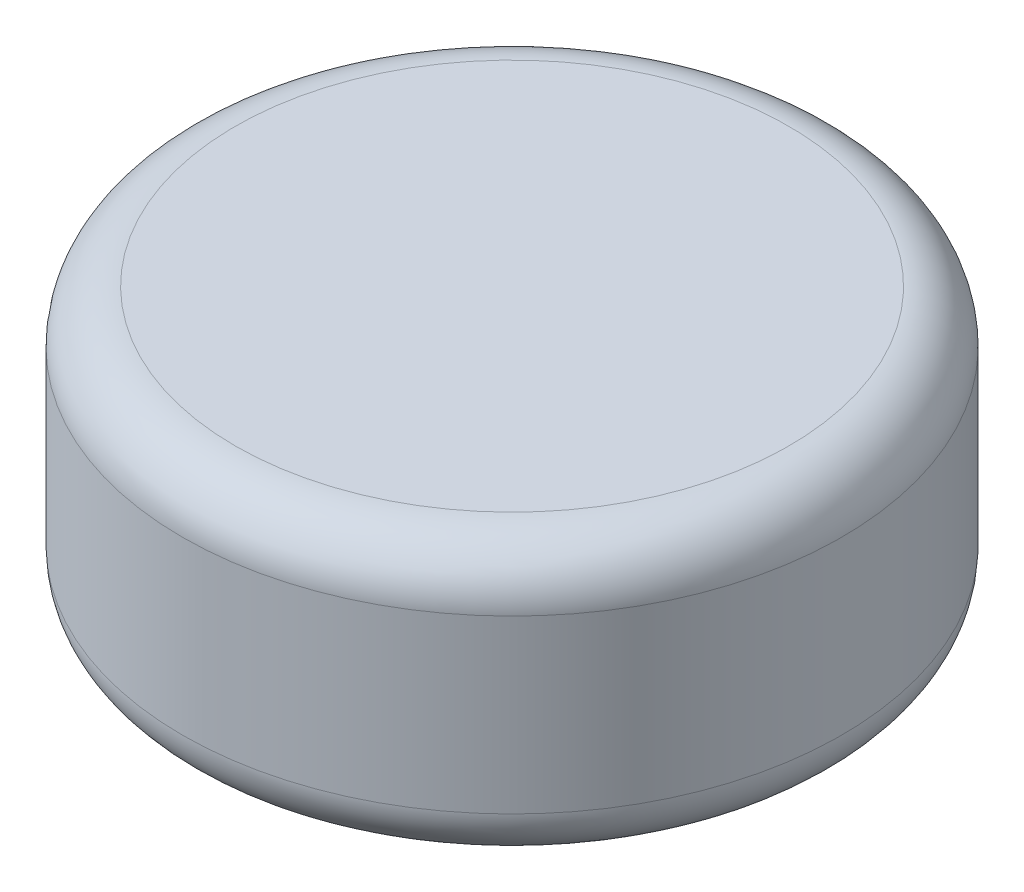
ISO-10303-21;
HEADER;
FILE_DESCRIPTION(('STEP AP214'),'2;1');
FILE_NAME('part.step','',(''),(''),'','','');
FILE_SCHEMA(('AUTOMOTIVE_DESIGN { 1 0 10303 214 1 1 1 1 }'));
ENDSEC;
DATA;
#1=APPLICATION_CONTEXT('core data for automotive mechanical design processes');
#2=APPLICATION_PROTOCOL_DEFINITION('international standard','automotive_design',2000,#1);
#3=PRODUCT_CONTEXT('',#1,'mechanical');
#4=PRODUCT('Part','Part','',(#3));
#5=PRODUCT_RELATED_PRODUCT_CATEGORY('part','',(#4));
#6=PRODUCT_DEFINITION_FORMATION('','',#4);
#7=PRODUCT_DEFINITION_CONTEXT('part definition',#1,'design');
#8=PRODUCT_DEFINITION('design','',#6,#7);
#9=PRODUCT_DEFINITION_SHAPE('','',#8);
#10=(LENGTH_UNIT() NAMED_UNIT(*) SI_UNIT(.MILLI.,.METRE.));
#11=(NAMED_UNIT(*) PLANE_ANGLE_UNIT() SI_UNIT($,.RADIAN.));
#12=(NAMED_UNIT(*) SI_UNIT($,.STERADIAN.) SOLID_ANGLE_UNIT());
#13=UNCERTAINTY_MEASURE_WITH_UNIT(LENGTH_MEASURE(1.E-05),#10,'distance_accuracy_value','');
#14=(GEOMETRIC_REPRESENTATION_CONTEXT(3) GLOBAL_UNCERTAINTY_ASSIGNED_CONTEXT((#13)) GLOBAL_UNIT_ASSIGNED_CONTEXT((#10,
#11,#12)) REPRESENTATION_CONTEXT('',''));
#15=CARTESIAN_POINT('',(0.,0.,0.));
#16=DIRECTION('',(0.,0.,1.));
#17=DIRECTION('',(1.,0.,0.));
#18=AXIS2_PLACEMENT_3D('',#15,#16,#17);
#19=CARTESIAN_POINT('',(0.,4.0005,0.));
#20=DIRECTION('',(0.,-1.,0.));
#21=DIRECTION('',(0.,0.,-1.));
#22=AXIS2_PLACEMENT_3D('',#19,#20,#21);
#23=CYLINDRICAL_SURFACE('',#22,9.525);
#24=CARTESIAN_POINT('',(0.,2.4765,0.));
#25=DIRECTION('',(0.,1.,0.));
#26=DIRECTION('',(0.,0.,1.));
#27=AXIS2_PLACEMENT_3D('',#24,#25,#26);
#28=CIRCLE('',#27,9.525);
#29=CARTESIAN_POINT('',(0.,2.4765,9.525));
#30=VERTEX_POINT('',#29);
#31=EDGE_CURVE('E52',#30,#30,#28,.F.);
#32=ORIENTED_EDGE('',*,*,#31,.T.);
#33=EDGE_LOOP('',(#32));
#34=FACE_BOUND('',#33,.T.);
#35=CARTESIAN_POINT('',(0.,-2.4765,0.));
#36=DIRECTION('',(0.,1.,0.));
#37=DIRECTION('',(0.,0.,1.));
#38=AXIS2_PLACEMENT_3D('',#35,#36,#37);
#39=CIRCLE('',#38,9.525);
#40=CARTESIAN_POINT('',(0.,-2.4765,9.525));
#41=VERTEX_POINT('',#40);
#42=EDGE_CURVE('E139',#41,#41,#39,.T.);
#43=ORIENTED_EDGE('',*,*,#42,.T.);
#44=EDGE_LOOP('',(#43));
#45=FACE_BOUND('',#44,.T.);
#46=ADVANCED_FACE('F42',(#34,#45),#23,.T.);
#47=CARTESIAN_POINT('',(0.,4.0005,0.));
#48=DIRECTION('',(0.,1.,0.));
#49=DIRECTION('',(0.,0.,1.));
#50=AXIS2_PLACEMENT_3D('',#47,#48,#49);
#51=PLANE('',#50);
#52=CARTESIAN_POINT('',(0.,4.0005,0.));
#53=DIRECTION('',(0.,1.,0.));
#54=DIRECTION('',(0.,0.,1.));
#55=AXIS2_PLACEMENT_3D('',#52,#53,#54);
#56=CIRCLE('',#55,8.001);
#57=CARTESIAN_POINT('',(0.,4.0005,8.001));
#58=VERTEX_POINT('',#57);
#59=EDGE_CURVE('E131',#58,#58,#56,.T.);
#60=ORIENTED_EDGE('',*,*,#59,.T.);
#61=EDGE_LOOP('',(#60));
#62=FACE_BOUND('',#61,.T.);
#63=ADVANCED_FACE('F154',(#62),#51,.T.);
#64=CARTESIAN_POINT('',(0.,-4.0005,0.));
#65=DIRECTION('',(0.,1.,0.));
#66=DIRECTION('',(0.,0.,1.));
#67=AXIS2_PLACEMENT_3D('',#64,#65,#66);
#68=PLANE('',#67);
#69=CARTESIAN_POINT('',(0.,-4.0005,0.));
#70=DIRECTION('',(0.,1.,0.));
#71=DIRECTION('',(0.,0.,1.));
#72=AXIS2_PLACEMENT_3D('',#69,#70,#71);
#73=CIRCLE('',#72,8.001);
#74=CARTESIAN_POINT('',(0.,-4.0005,8.001));
#75=VERTEX_POINT('',#74);
#76=EDGE_CURVE('E11',#75,#75,#73,.F.);
#77=ORIENTED_EDGE('',*,*,#76,.T.);
#78=EDGE_LOOP('',(#77));
#79=FACE_BOUND('',#78,.T.);
#80=ADVANCED_FACE('F151',(#79),#68,.F.);
#81=CARTESIAN_POINT('',(0.,2.4765,0.));
#82=DIRECTION('',(0.,1.,0.));
#83=DIRECTION('',(0.,0.,1.));
#84=AXIS2_PLACEMENT_3D('',#81,#82,#83);
#85=TOROIDAL_SURFACE('',#84,8.001,1.524);
#86=ORIENTED_EDGE('',*,*,#31,.F.);
#87=EDGE_LOOP('',(#86));
#88=FACE_BOUND('',#87,.T.);
#89=ORIENTED_EDGE('',*,*,#59,.F.);
#90=EDGE_LOOP('',(#89));
#91=FACE_BOUND('',#90,.T.);
#92=ADVANCED_FACE('F148',(#88,#91),#85,.T.);
#93=CARTESIAN_POINT('',(0.,-2.4765,0.));
#94=DIRECTION('',(0.,1.,0.));
#95=DIRECTION('',(0.,0.,1.));
#96=AXIS2_PLACEMENT_3D('',#93,#94,#95);
#97=TOROIDAL_SURFACE('',#96,8.001,1.524);
#98=ORIENTED_EDGE('',*,*,#76,.F.);
#99=EDGE_LOOP('',(#98));
#100=FACE_BOUND('',#99,.T.);
#101=ORIENTED_EDGE('',*,*,#42,.F.);
#102=EDGE_LOOP('',(#101));
#103=FACE_BOUND('',#102,.T.);
#104=ADVANCED_FACE('F44',(#100,#103),#97,.T.);
#105=CLOSED_SHELL('',(#46,#63,#80,#92,#104));
#106=CARTESIAN_POINT('',(0.,-3.3655,3.3655));
#107=DIRECTION('',(0.,0.,1.));
#108=DIRECTION('',(1.,0.,0.));
#109=AXIS2_PLACEMENT_3D('',#106,#107,#108);
#110=PLANE('',#109);
#111=DIRECTION('',(1.,0.,0.));
#112=VECTOR('',#111,1.);
#113=CARTESIAN_POINT('',(0.,3.3655,3.3655));
#114=LINE('',#113,#112);
#115=CARTESIAN_POINT('',(-3.3655,3.3655,3.3655));
#116=VERTEX_POINT('',#115);
#117=CARTESIAN_POINT('',(3.3655,3.3655,3.3655));
#118=VERTEX_POINT('',#117);
#119=EDGE_CURVE('E119',#116,#118,#114,.T.);
#120=ORIENTED_EDGE('',*,*,#119,.T.);
#121=DIRECTION('',(0.,1.,0.));
#122=VECTOR('',#121,1.);
#123=CARTESIAN_POINT('',(3.3655,-3.3655,3.3655));
#124=LINE('',#123,#122);
#125=CARTESIAN_POINT('',(3.3655,-3.3655,3.3655));
#126=VERTEX_POINT('',#125);
#127=EDGE_CURVE('E84',#126,#118,#124,.T.);
#128=ORIENTED_EDGE('',*,*,#127,.F.);
#129=DIRECTION('',(1.,0.,0.));
#130=VECTOR('',#129,1.);
#131=CARTESIAN_POINT('',(0.,-3.3655,3.3655));
#132=LINE('',#131,#130);
#133=CARTESIAN_POINT('',(-3.3655,-3.3655,3.3655));
#134=VERTEX_POINT('',#133);
#135=EDGE_CURVE('E111',#134,#126,#132,.T.);
#136=ORIENTED_EDGE('',*,*,#135,.F.);
#137=DIRECTION('',(0.,1.,0.));
#138=VECTOR('',#137,1.);
#139=CARTESIAN_POINT('',(-3.3655,-3.3655,3.3655));
#140=LINE('',#139,#138);
#141=EDGE_CURVE('E60',#134,#116,#140,.T.);
#142=ORIENTED_EDGE('',*,*,#141,.T.);
#143=EDGE_LOOP('',(#120,#128,#136,#142));
#144=FACE_BOUND('',#143,.T.);
#145=ADVANCED_FACE('F165',(#144),#110,.F.);
#146=CARTESIAN_POINT('',(-3.3655,-3.3655,0.));
#147=DIRECTION('',(1.,0.,0.));
#148=DIRECTION('',(0.,0.,-1.));
#149=AXIS2_PLACEMENT_3D('',#146,#147,#148);
#150=PLANE('',#149);
#151=DIRECTION('',(0.,0.,-1.));
#152=VECTOR('',#151,1.);
#153=CARTESIAN_POINT('',(-3.3655,3.3655,0.));
#154=LINE('',#153,#152);
#155=CARTESIAN_POINT('',(-3.3655,3.3655,-3.3655));
#156=VERTEX_POINT('',#155);
#157=EDGE_CURVE('E76',#116,#156,#154,.T.);
#158=ORIENTED_EDGE('',*,*,#157,.F.);
#159=ORIENTED_EDGE('',*,*,#141,.F.);
#160=DIRECTION('',(0.,0.,-1.));
#161=VECTOR('',#160,1.);
#162=CARTESIAN_POINT('',(-3.3655,-3.3655,0.));
#163=LINE('',#162,#161);
#164=CARTESIAN_POINT('',(-3.3655,-3.3655,-3.3655));
#165=VERTEX_POINT('',#164);
#166=EDGE_CURVE('E99',#134,#165,#163,.T.);
#167=ORIENTED_EDGE('',*,*,#166,.T.);
#168=DIRECTION('',(0.,1.,0.));
#169=VECTOR('',#168,1.);
#170=CARTESIAN_POINT('',(-3.3655,-3.3655,-3.3655));
#171=LINE('',#170,#169);
#172=EDGE_CURVE('E95',#165,#156,#171,.T.);
#173=ORIENTED_EDGE('',*,*,#172,.T.);
#174=EDGE_LOOP('',(#158,#159,#167,#173));
#175=FACE_BOUND('',#174,.T.);
#176=ADVANCED_FACE('F168',(#175),#150,.T.);
#177=CARTESIAN_POINT('',(0.,-3.3655,-3.3655));
#178=DIRECTION('',(0.,0.,1.));
#179=DIRECTION('',(1.,0.,0.));
#180=AXIS2_PLACEMENT_3D('',#177,#178,#179);
#181=PLANE('',#180);
#182=DIRECTION('',(1.,0.,0.));
#183=VECTOR('',#182,1.);
#184=CARTESIAN_POINT('',(0.,3.3655,-3.3655));
#185=LINE('',#184,#183);
#186=CARTESIAN_POINT('',(3.3655,3.3655,-3.3655));
#187=VERTEX_POINT('',#186);
#188=EDGE_CURVE('E124',#156,#187,#185,.T.);
#189=ORIENTED_EDGE('',*,*,#188,.F.);
#190=ORIENTED_EDGE('',*,*,#172,.F.);
#191=DIRECTION('',(1.,0.,0.));
#192=VECTOR('',#191,1.);
#193=CARTESIAN_POINT('',(0.,-3.3655,-3.3655));
#194=LINE('',#193,#192);
#195=CARTESIAN_POINT('',(3.3655,-3.3655,-3.3655));
#196=VERTEX_POINT('',#195);
#197=EDGE_CURVE('E90',#165,#196,#194,.T.);
#198=ORIENTED_EDGE('',*,*,#197,.T.);
#199=DIRECTION('',(0.,1.,0.));
#200=VECTOR('',#199,1.);
#201=CARTESIAN_POINT('',(3.3655,-3.3655,-3.3655));
#202=LINE('',#201,#200);
#203=EDGE_CURVE('E94',#196,#187,#202,.T.);
#204=ORIENTED_EDGE('',*,*,#203,.T.);
#205=EDGE_LOOP('',(#189,#190,#198,#204));
#206=FACE_BOUND('',#205,.T.);
#207=ADVANCED_FACE('F93',(#206),#181,.T.);
#208=CARTESIAN_POINT('',(3.3655,-3.3655,0.));
#209=DIRECTION('',(1.,0.,0.));
#210=DIRECTION('',(0.,0.,-1.));
#211=AXIS2_PLACEMENT_3D('',#208,#209,#210);
#212=PLANE('',#211);
#213=DIRECTION('',(0.,0.,-1.));
#214=VECTOR('',#213,1.);
#215=CARTESIAN_POINT('',(3.3655,3.3655,0.));
#216=LINE('',#215,#214);
#217=EDGE_CURVE('E107',#118,#187,#216,.T.);
#218=ORIENTED_EDGE('',*,*,#217,.T.);
#219=ORIENTED_EDGE('',*,*,#203,.F.);
#220=DIRECTION('',(0.,0.,-1.));
#221=VECTOR('',#220,1.);
#222=CARTESIAN_POINT('',(3.3655,-3.3655,0.));
#223=LINE('',#222,#221);
#224=EDGE_CURVE('E100',#126,#196,#223,.T.);
#225=ORIENTED_EDGE('',*,*,#224,.F.);
#226=ORIENTED_EDGE('',*,*,#127,.T.);
#227=EDGE_LOOP('',(#218,#219,#225,#226));
#228=FACE_BOUND('',#227,.T.);
#229=ADVANCED_FACE('F104',(#228),#212,.F.);
#230=CARTESIAN_POINT('',(0.,-3.3655,0.));
#231=DIRECTION('',(0.,1.,0.));
#232=DIRECTION('',(0.,0.,1.));
#233=AXIS2_PLACEMENT_3D('',#230,#231,#232);
#234=PLANE('',#233);
#235=ORIENTED_EDGE('',*,*,#135,.T.);
#236=ORIENTED_EDGE('',*,*,#224,.T.);
#237=ORIENTED_EDGE('',*,*,#197,.F.);
#238=ORIENTED_EDGE('',*,*,#166,.F.);
#239=EDGE_LOOP('',(#235,#236,#237,#238));
#240=FACE_BOUND('',#239,.T.);
#241=ADVANCED_FACE('F110',(#240),#234,.T.);
#242=CARTESIAN_POINT('',(0.,3.3655,0.));
#243=DIRECTION('',(0.,1.,0.));
#244=DIRECTION('',(0.,0.,1.));
#245=AXIS2_PLACEMENT_3D('',#242,#243,#244);
#246=PLANE('',#245);
#247=ORIENTED_EDGE('',*,*,#119,.F.);
#248=ORIENTED_EDGE('',*,*,#157,.T.);
#249=ORIENTED_EDGE('',*,*,#188,.T.);
#250=ORIENTED_EDGE('',*,*,#217,.F.);
#251=EDGE_LOOP('',(#247,#248,#249,#250));
#252=FACE_BOUND('',#251,.T.);
#253=ADVANCED_FACE('F176',(#252),#246,.F.);
#254=CLOSED_SHELL('',(#145,#176,#207,#229,#241,#253));
#255=ORIENTED_CLOSED_SHELL('',*,#105,.T.);
#256=BREP_WITH_VOIDS('B2',#254,(#255));
#257=ADVANCED_BREP_SHAPE_REPRESENTATION('',(#18,#256),#14);
#258=SHAPE_DEFINITION_REPRESENTATION(#9,#257);
ENDSEC;
END-ISO-10303-21;
